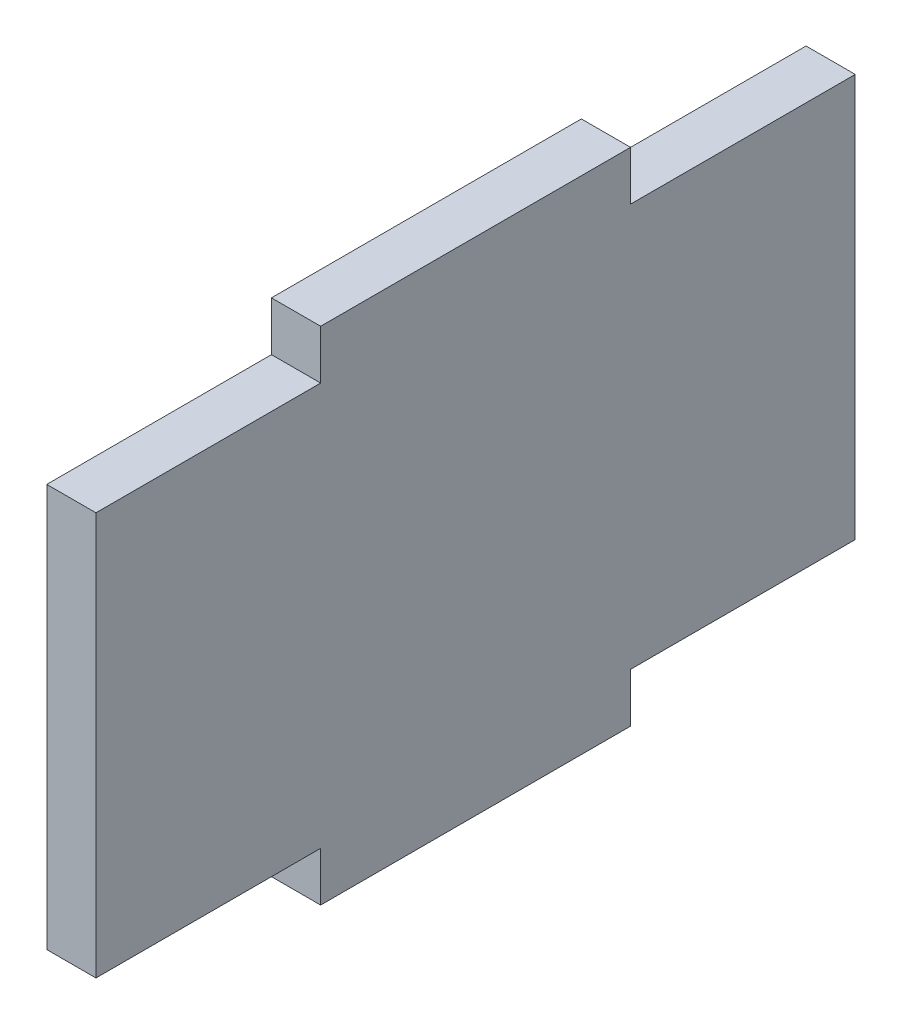
ISO-10303-21;
HEADER;
FILE_DESCRIPTION(('STEP AP214'),'2;1');
FILE_NAME('part.step','',(''),(''),'','','');
FILE_SCHEMA(('AUTOMOTIVE_DESIGN { 1 0 10303 214 1 1 1 1 }'));
ENDSEC;
DATA;
#1=APPLICATION_CONTEXT('core data for automotive mechanical design processes');
#2=APPLICATION_PROTOCOL_DEFINITION('international standard','automotive_design',2000,#1);
#3=PRODUCT_CONTEXT('',#1,'mechanical');
#4=PRODUCT('Part','Part','',(#3));
#5=PRODUCT_RELATED_PRODUCT_CATEGORY('part','',(#4));
#6=PRODUCT_DEFINITION_FORMATION('','',#4);
#7=PRODUCT_DEFINITION_CONTEXT('part definition',#1,'design');
#8=PRODUCT_DEFINITION('design','',#6,#7);
#9=PRODUCT_DEFINITION_SHAPE('','',#8);
#10=(LENGTH_UNIT() NAMED_UNIT(*) SI_UNIT(.MILLI.,.METRE.));
#11=(NAMED_UNIT(*) PLANE_ANGLE_UNIT() SI_UNIT($,.RADIAN.));
#12=(NAMED_UNIT(*) SI_UNIT($,.STERADIAN.) SOLID_ANGLE_UNIT());
#13=UNCERTAINTY_MEASURE_WITH_UNIT(LENGTH_MEASURE(1.E-05),#10,'distance_accuracy_value','');
#14=(GEOMETRIC_REPRESENTATION_CONTEXT(3) GLOBAL_UNCERTAINTY_ASSIGNED_CONTEXT((#13)) GLOBAL_UNIT_ASSIGNED_CONTEXT((#10,
#11,#12)) REPRESENTATION_CONTEXT('',''));
#15=CARTESIAN_POINT('',(0.,0.,0.));
#16=DIRECTION('',(0.,0.,1.));
#17=DIRECTION('',(1.,0.,0.));
#18=AXIS2_PLACEMENT_3D('',#15,#16,#17);
#19=CARTESIAN_POINT('',(3.175,0.,-10.));
#20=DIRECTION('',(0.,0.,-1.));
#21=DIRECTION('',(0.,1.,0.));
#22=AXIS2_PLACEMENT_3D('',#19,#20,#21);
#23=PLANE('',#22);
#24=DIRECTION('',(0.,-1.,0.));
#25=VECTOR('',#24,1.);
#26=CARTESIAN_POINT('',(0.,0.,-10.));
#27=LINE('',#26,#25);
#28=CARTESIAN_POINT('',(0.,16.175,-10.));
#29=VERTEX_POINT('',#28);
#30=CARTESIAN_POINT('',(0.,13.,-10.));
#31=VERTEX_POINT('',#30);
#32=EDGE_CURVE('E152',#29,#31,#27,.T.);
#33=ORIENTED_EDGE('',*,*,#32,.F.);
#34=DIRECTION('',(-1.,0.,0.));
#35=VECTOR('',#34,1.);
#36=CARTESIAN_POINT('',(3.175,16.175,-10.));
#37=LINE('',#36,#35);
#38=CARTESIAN_POINT('',(3.175,16.175,-10.));
#39=VERTEX_POINT('',#38);
#40=EDGE_CURVE('E11',#39,#29,#37,.T.);
#41=ORIENTED_EDGE('',*,*,#40,.F.);
#42=DIRECTION('',(0.,-1.,0.));
#43=VECTOR('',#42,1.);
#44=CARTESIAN_POINT('',(3.175,0.,-10.));
#45=LINE('',#44,#43);
#46=CARTESIAN_POINT('',(3.175,13.,-10.));
#47=VERTEX_POINT('',#46);
#48=EDGE_CURVE('E211',#39,#47,#45,.T.);
#49=ORIENTED_EDGE('',*,*,#48,.T.);
#50=DIRECTION('',(-1.,0.,0.));
#51=VECTOR('',#50,1.);
#52=CARTESIAN_POINT('',(3.175,13.,-10.));
#53=LINE('',#52,#51);
#54=EDGE_CURVE('E48',#47,#31,#53,.T.);
#55=ORIENTED_EDGE('',*,*,#54,.T.);
#56=EDGE_LOOP('',(#33,#41,#49,#55));
#57=FACE_BOUND('',#56,.T.);
#58=ADVANCED_FACE('F32',(#57),#23,.T.);
#59=CARTESIAN_POINT('',(3.175,16.175,0.));
#60=DIRECTION('',(0.,1.,0.));
#61=DIRECTION('',(0.,0.,1.));
#62=AXIS2_PLACEMENT_3D('',#59,#60,#61);
#63=PLANE('',#62);
#64=DIRECTION('',(0.,0.,-1.));
#65=VECTOR('',#64,1.);
#66=CARTESIAN_POINT('',(0.,16.175,0.));
#67=LINE('',#66,#65);
#68=CARTESIAN_POINT('',(0.,16.175,10.));
#69=VERTEX_POINT('',#68);
#70=EDGE_CURVE('E154',#69,#29,#67,.T.);
#71=ORIENTED_EDGE('',*,*,#70,.F.);
#72=DIRECTION('',(-1.,0.,0.));
#73=VECTOR('',#72,1.);
#74=CARTESIAN_POINT('',(3.175,16.175,10.));
#75=LINE('',#74,#73);
#76=CARTESIAN_POINT('',(3.175,16.175,10.));
#77=VERTEX_POINT('',#76);
#78=EDGE_CURVE('E40',#77,#69,#75,.T.);
#79=ORIENTED_EDGE('',*,*,#78,.F.);
#80=DIRECTION('',(0.,0.,-1.));
#81=VECTOR('',#80,1.);
#82=CARTESIAN_POINT('',(3.175,16.175,0.));
#83=LINE('',#82,#81);
#84=EDGE_CURVE('E208',#77,#39,#83,.T.);
#85=ORIENTED_EDGE('',*,*,#84,.T.);
#86=ORIENTED_EDGE('',*,*,#40,.T.);
#87=EDGE_LOOP('',(#71,#79,#85,#86));
#88=FACE_BOUND('',#87,.T.);
#89=ADVANCED_FACE('F207',(#88),#63,.T.);
#90=CARTESIAN_POINT('',(3.175,0.,10.));
#91=DIRECTION('',(0.,0.,-1.));
#92=DIRECTION('',(-1.,0.,0.));
#93=AXIS2_PLACEMENT_3D('',#90,#91,#92);
#94=PLANE('',#93);
#95=DIRECTION('',(0.,-1.,0.));
#96=VECTOR('',#95,1.);
#97=CARTESIAN_POINT('',(0.,0.,10.));
#98=LINE('',#97,#96);
#99=CARTESIAN_POINT('',(0.,13.,10.));
#100=VERTEX_POINT('',#99);
#101=EDGE_CURVE('E157',#69,#100,#98,.T.);
#102=ORIENTED_EDGE('',*,*,#101,.T.);
#103=DIRECTION('',(-1.,0.,0.));
#104=VECTOR('',#103,1.);
#105=CARTESIAN_POINT('',(3.175,13.,10.));
#106=LINE('',#105,#104);
#107=CARTESIAN_POINT('',(3.175,13.,10.));
#108=VERTEX_POINT('',#107);
#109=EDGE_CURVE('E193',#108,#100,#106,.T.);
#110=ORIENTED_EDGE('',*,*,#109,.F.);
#111=DIRECTION('',(0.,-1.,0.));
#112=VECTOR('',#111,1.);
#113=CARTESIAN_POINT('',(3.175,0.,10.));
#114=LINE('',#113,#112);
#115=EDGE_CURVE('E199',#77,#108,#114,.T.);
#116=ORIENTED_EDGE('',*,*,#115,.F.);
#117=ORIENTED_EDGE('',*,*,#78,.T.);
#118=EDGE_LOOP('',(#102,#110,#116,#117));
#119=FACE_BOUND('',#118,.T.);
#120=ADVANCED_FACE('F197',(#119),#94,.F.);
#121=CARTESIAN_POINT('',(3.175,13.,0.));
#122=DIRECTION('',(0.,1.,0.));
#123=DIRECTION('',(0.,0.,1.));
#124=AXIS2_PLACEMENT_3D('',#121,#122,#123);
#125=PLANE('',#124);
#126=DIRECTION('',(0.,0.,-1.));
#127=VECTOR('',#126,1.);
#128=CARTESIAN_POINT('',(0.,13.,0.));
#129=LINE('',#128,#127);
#130=CARTESIAN_POINT('',(0.,13.,24.5));
#131=VERTEX_POINT('',#130);
#132=EDGE_CURVE('E160',#131,#100,#129,.T.);
#133=ORIENTED_EDGE('',*,*,#132,.F.);
#134=DIRECTION('',(-1.,0.,0.));
#135=VECTOR('',#134,1.);
#136=CARTESIAN_POINT('',(3.175,13.,24.5));
#137=LINE('',#136,#135);
#138=CARTESIAN_POINT('',(3.175,13.,24.5));
#139=VERTEX_POINT('',#138);
#140=EDGE_CURVE('E191',#139,#131,#137,.T.);
#141=ORIENTED_EDGE('',*,*,#140,.F.);
#142=DIRECTION('',(0.,0.,-1.));
#143=VECTOR('',#142,1.);
#144=CARTESIAN_POINT('',(3.175,13.,0.));
#145=LINE('',#144,#143);
#146=EDGE_CURVE('E148',#139,#108,#145,.T.);
#147=ORIENTED_EDGE('',*,*,#146,.T.);
#148=ORIENTED_EDGE('',*,*,#109,.T.);
#149=EDGE_LOOP('',(#133,#141,#147,#148));
#150=FACE_BOUND('',#149,.T.);
#151=ADVANCED_FACE('F246',(#150),#125,.T.);
#152=CARTESIAN_POINT('',(3.175,0.,24.5));
#153=DIRECTION('',(0.,0.,1.));
#154=DIRECTION('',(1.,0.,0.));
#155=AXIS2_PLACEMENT_3D('',#152,#153,#154);
#156=PLANE('',#155);
#157=DIRECTION('',(0.,1.,0.));
#158=VECTOR('',#157,1.);
#159=CARTESIAN_POINT('',(0.,0.,24.5));
#160=LINE('',#159,#158);
#161=CARTESIAN_POINT('',(0.,-13.,24.5));
#162=VERTEX_POINT('',#161);
#163=EDGE_CURVE('E163',#162,#131,#160,.T.);
#164=ORIENTED_EDGE('',*,*,#163,.F.);
#165=DIRECTION('',(-1.,0.,0.));
#166=VECTOR('',#165,1.);
#167=CARTESIAN_POINT('',(3.175,-13.,24.5));
#168=LINE('',#167,#166);
#169=CARTESIAN_POINT('',(3.175,-13.,24.5));
#170=VERTEX_POINT('',#169);
#171=EDGE_CURVE('E189',#170,#162,#168,.T.);
#172=ORIENTED_EDGE('',*,*,#171,.F.);
#173=DIRECTION('',(0.,1.,0.));
#174=VECTOR('',#173,1.);
#175=CARTESIAN_POINT('',(3.175,0.,24.5));
#176=LINE('',#175,#174);
#177=EDGE_CURVE('E217',#170,#139,#176,.T.);
#178=ORIENTED_EDGE('',*,*,#177,.T.);
#179=ORIENTED_EDGE('',*,*,#140,.T.);
#180=EDGE_LOOP('',(#164,#172,#178,#179));
#181=FACE_BOUND('',#180,.T.);
#182=ADVANCED_FACE('F242',(#181),#156,.T.);
#183=CARTESIAN_POINT('',(3.175,-13.,0.));
#184=DIRECTION('',(0.,1.,0.));
#185=DIRECTION('',(0.,0.,1.));
#186=AXIS2_PLACEMENT_3D('',#183,#184,#185);
#187=PLANE('',#186);
#188=DIRECTION('',(0.,0.,-1.));
#189=VECTOR('',#188,1.);
#190=CARTESIAN_POINT('',(0.,-13.,0.));
#191=LINE('',#190,#189);
#192=CARTESIAN_POINT('',(0.,-13.,10.));
#193=VERTEX_POINT('',#192);
#194=EDGE_CURVE('E167',#162,#193,#191,.T.);
#195=ORIENTED_EDGE('',*,*,#194,.T.);
#196=DIRECTION('',(-1.,0.,0.));
#197=VECTOR('',#196,1.);
#198=CARTESIAN_POINT('',(3.175,-13.,10.));
#199=LINE('',#198,#197);
#200=CARTESIAN_POINT('',(3.175,-13.,10.));
#201=VERTEX_POINT('',#200);
#202=EDGE_CURVE('E187',#201,#193,#199,.T.);
#203=ORIENTED_EDGE('',*,*,#202,.F.);
#204=DIRECTION('',(0.,0.,-1.));
#205=VECTOR('',#204,1.);
#206=CARTESIAN_POINT('',(3.175,-13.,0.));
#207=LINE('',#206,#205);
#208=EDGE_CURVE('E134',#170,#201,#207,.T.);
#209=ORIENTED_EDGE('',*,*,#208,.F.);
#210=ORIENTED_EDGE('',*,*,#171,.T.);
#211=EDGE_LOOP('',(#195,#203,#209,#210));
#212=FACE_BOUND('',#211,.T.);
#213=ADVANCED_FACE('F239',(#212),#187,.F.);
#214=CARTESIAN_POINT('',(3.175,0.,10.));
#215=DIRECTION('',(0.,0.,1.));
#216=DIRECTION('',(1.,0.,0.));
#217=AXIS2_PLACEMENT_3D('',#214,#215,#216);
#218=PLANE('',#217);
#219=DIRECTION('',(0.,1.,0.));
#220=VECTOR('',#219,1.);
#221=CARTESIAN_POINT('',(0.,0.,10.));
#222=LINE('',#221,#220);
#223=CARTESIAN_POINT('',(0.,-16.175,10.));
#224=VERTEX_POINT('',#223);
#225=EDGE_CURVE('E170',#224,#193,#222,.T.);
#226=ORIENTED_EDGE('',*,*,#225,.F.);
#227=DIRECTION('',(-1.,0.,0.));
#228=VECTOR('',#227,1.);
#229=CARTESIAN_POINT('',(3.175,-16.175,10.));
#230=LINE('',#229,#228);
#231=CARTESIAN_POINT('',(3.175,-16.175,10.));
#232=VERTEX_POINT('',#231);
#233=EDGE_CURVE('E185',#232,#224,#230,.T.);
#234=ORIENTED_EDGE('',*,*,#233,.F.);
#235=DIRECTION('',(0.,1.,0.));
#236=VECTOR('',#235,1.);
#237=CARTESIAN_POINT('',(3.175,0.,10.));
#238=LINE('',#237,#236);
#239=EDGE_CURVE('E220',#232,#201,#238,.T.);
#240=ORIENTED_EDGE('',*,*,#239,.T.);
#241=ORIENTED_EDGE('',*,*,#202,.T.);
#242=EDGE_LOOP('',(#226,#234,#240,#241));
#243=FACE_BOUND('',#242,.T.);
#244=ADVANCED_FACE('F235',(#243),#218,.T.);
#245=CARTESIAN_POINT('',(3.175,-16.175,0.));
#246=DIRECTION('',(0.,1.,0.));
#247=DIRECTION('',(0.,0.,1.));
#248=AXIS2_PLACEMENT_3D('',#245,#246,#247);
#249=PLANE('',#248);
#250=DIRECTION('',(0.,0.,-1.));
#251=VECTOR('',#250,1.);
#252=CARTESIAN_POINT('',(0.,-16.175,0.));
#253=LINE('',#252,#251);
#254=CARTESIAN_POINT('',(0.,-16.175,-10.));
#255=VERTEX_POINT('',#254);
#256=EDGE_CURVE('E173',#224,#255,#253,.T.);
#257=ORIENTED_EDGE('',*,*,#256,.T.);
#258=DIRECTION('',(-1.,0.,0.));
#259=VECTOR('',#258,1.);
#260=CARTESIAN_POINT('',(3.175,-16.175,-10.));
#261=LINE('',#260,#259);
#262=CARTESIAN_POINT('',(3.175,-16.175,-10.));
#263=VERTEX_POINT('',#262);
#264=EDGE_CURVE('E182',#263,#255,#261,.T.);
#265=ORIENTED_EDGE('',*,*,#264,.F.);
#266=DIRECTION('',(0.,0.,-1.));
#267=VECTOR('',#266,1.);
#268=CARTESIAN_POINT('',(3.175,-16.175,0.));
#269=LINE('',#268,#267);
#270=EDGE_CURVE('E222',#232,#263,#269,.T.);
#271=ORIENTED_EDGE('',*,*,#270,.F.);
#272=ORIENTED_EDGE('',*,*,#233,.T.);
#273=EDGE_LOOP('',(#257,#265,#271,#272));
#274=FACE_BOUND('',#273,.T.);
#275=ADVANCED_FACE('F227',(#274),#249,.F.);
#276=CARTESIAN_POINT('',(3.175,0.,-10.));
#277=DIRECTION('',(0.,0.,1.));
#278=DIRECTION('',(0.,-1.,0.));
#279=AXIS2_PLACEMENT_3D('',#276,#277,#278);
#280=PLANE('',#279);
#281=DIRECTION('',(0.,1.,0.));
#282=VECTOR('',#281,1.);
#283=CARTESIAN_POINT('',(0.,0.,-10.));
#284=LINE('',#283,#282);
#285=CARTESIAN_POINT('',(0.,-13.,-10.));
#286=VERTEX_POINT('',#285);
#287=EDGE_CURVE('E175',#255,#286,#284,.T.);
#288=ORIENTED_EDGE('',*,*,#287,.T.);
#289=DIRECTION('',(-1.,0.,0.));
#290=VECTOR('',#289,1.);
#291=CARTESIAN_POINT('',(3.175,-13.,-10.));
#292=LINE('',#291,#290);
#293=CARTESIAN_POINT('',(3.175,-13.,-10.));
#294=VERTEX_POINT('',#293);
#295=EDGE_CURVE('E142',#294,#286,#292,.T.);
#296=ORIENTED_EDGE('',*,*,#295,.F.);
#297=DIRECTION('',(0.,1.,0.));
#298=VECTOR('',#297,1.);
#299=CARTESIAN_POINT('',(3.175,0.,-10.));
#300=LINE('',#299,#298);
#301=EDGE_CURVE('E129',#263,#294,#300,.T.);
#302=ORIENTED_EDGE('',*,*,#301,.F.);
#303=ORIENTED_EDGE('',*,*,#264,.T.);
#304=EDGE_LOOP('',(#288,#296,#302,#303));
#305=FACE_BOUND('',#304,.T.);
#306=ADVANCED_FACE('F231',(#305),#280,.F.);
#307=CARTESIAN_POINT('',(0.,-13.,-24.5));
#308=VERTEX_POINT('',#307);
#309=EDGE_CURVE('E139',#286,#308,#191,.T.);
#310=ORIENTED_EDGE('',*,*,#309,.T.);
#311=DIRECTION('',(-1.,0.,0.));
#312=VECTOR('',#311,1.);
#313=CARTESIAN_POINT('',(3.175,-13.,-24.5));
#314=LINE('',#313,#312);
#315=CARTESIAN_POINT('',(3.175,-13.,-24.5));
#316=VERTEX_POINT('',#315);
#317=EDGE_CURVE('E136',#316,#308,#314,.T.);
#318=ORIENTED_EDGE('',*,*,#317,.F.);
#319=EDGE_CURVE('E122',#294,#316,#207,.T.);
#320=ORIENTED_EDGE('',*,*,#319,.F.);
#321=ORIENTED_EDGE('',*,*,#295,.T.);
#322=EDGE_LOOP('',(#310,#318,#320,#321));
#323=FACE_BOUND('',#322,.T.);
#324=ADVANCED_FACE('F137',(#323),#187,.F.);
#325=CARTESIAN_POINT('',(3.175,0.,-24.5));
#326=DIRECTION('',(0.,0.,1.));
#327=DIRECTION('',(1.,0.,0.));
#328=AXIS2_PLACEMENT_3D('',#325,#326,#327);
#329=PLANE('',#328);
#330=DIRECTION('',(0.,1.,0.));
#331=VECTOR('',#330,1.);
#332=CARTESIAN_POINT('',(0.,0.,-24.5));
#333=LINE('',#332,#331);
#334=CARTESIAN_POINT('',(0.,13.,-24.5));
#335=VERTEX_POINT('',#334);
#336=EDGE_CURVE('E177',#308,#335,#333,.T.);
#337=ORIENTED_EDGE('',*,*,#336,.T.);
#338=DIRECTION('',(-1.,0.,0.));
#339=VECTOR('',#338,1.);
#340=CARTESIAN_POINT('',(3.175,13.,-24.5));
#341=LINE('',#340,#339);
#342=CARTESIAN_POINT('',(3.175,13.,-24.5));
#343=VERTEX_POINT('',#342);
#344=EDGE_CURVE('E86',#343,#335,#341,.T.);
#345=ORIENTED_EDGE('',*,*,#344,.F.);
#346=DIRECTION('',(0.,1.,0.));
#347=VECTOR('',#346,1.);
#348=CARTESIAN_POINT('',(3.175,0.,-24.5));
#349=LINE('',#348,#347);
#350=EDGE_CURVE('E127',#316,#343,#349,.T.);
#351=ORIENTED_EDGE('',*,*,#350,.F.);
#352=ORIENTED_EDGE('',*,*,#317,.T.);
#353=EDGE_LOOP('',(#337,#345,#351,#352));
#354=FACE_BOUND('',#353,.T.);
#355=ADVANCED_FACE('F144',(#354),#329,.F.);
#356=EDGE_CURVE('E164',#31,#335,#129,.T.);
#357=ORIENTED_EDGE('',*,*,#356,.F.);
#358=ORIENTED_EDGE('',*,*,#54,.F.);
#359=EDGE_CURVE('E145',#47,#343,#145,.T.);
#360=ORIENTED_EDGE('',*,*,#359,.T.);
#361=ORIENTED_EDGE('',*,*,#344,.T.);
#362=EDGE_LOOP('',(#357,#358,#360,#361));
#363=FACE_BOUND('',#362,.T.);
#364=ADVANCED_FACE('F210',(#363),#125,.T.);
#365=CARTESIAN_POINT('',(3.175,0.,0.));
#366=DIRECTION('',(1.,0.,0.));
#367=DIRECTION('',(0.,0.,-1.));
#368=AXIS2_PLACEMENT_3D('',#365,#366,#367);
#369=PLANE('',#368);
#370=ORIENTED_EDGE('',*,*,#48,.F.);
#371=ORIENTED_EDGE('',*,*,#84,.F.);
#372=ORIENTED_EDGE('',*,*,#115,.T.);
#373=ORIENTED_EDGE('',*,*,#146,.F.);
#374=ORIENTED_EDGE('',*,*,#177,.F.);
#375=ORIENTED_EDGE('',*,*,#208,.T.);
#376=ORIENTED_EDGE('',*,*,#239,.F.);
#377=ORIENTED_EDGE('',*,*,#270,.T.);
#378=ORIENTED_EDGE('',*,*,#301,.T.);
#379=ORIENTED_EDGE('',*,*,#319,.T.);
#380=ORIENTED_EDGE('',*,*,#350,.T.);
#381=ORIENTED_EDGE('',*,*,#359,.F.);
#382=EDGE_LOOP('',(#370,#371,#372,#373,#374,#375,#376,#377,#378,#379,#380,#381));
#383=FACE_BOUND('',#382,.T.);
#384=ADVANCED_FACE('F124',(#383),#369,.T.);
#385=CARTESIAN_POINT('',(0.,0.,0.));
#386=DIRECTION('',(1.,0.,0.));
#387=DIRECTION('',(0.,0.,-1.));
#388=AXIS2_PLACEMENT_3D('',#385,#386,#387);
#389=PLANE('',#388);
#390=ORIENTED_EDGE('',*,*,#32,.T.);
#391=ORIENTED_EDGE('',*,*,#356,.T.);
#392=ORIENTED_EDGE('',*,*,#336,.F.);
#393=ORIENTED_EDGE('',*,*,#309,.F.);
#394=ORIENTED_EDGE('',*,*,#287,.F.);
#395=ORIENTED_EDGE('',*,*,#256,.F.);
#396=ORIENTED_EDGE('',*,*,#225,.T.);
#397=ORIENTED_EDGE('',*,*,#194,.F.);
#398=ORIENTED_EDGE('',*,*,#163,.T.);
#399=ORIENTED_EDGE('',*,*,#132,.T.);
#400=ORIENTED_EDGE('',*,*,#101,.F.);
#401=ORIENTED_EDGE('',*,*,#70,.T.);
#402=EDGE_LOOP('',(#390,#391,#392,#393,#394,#395,#396,#397,#398,#399,#400,#401));
#403=FACE_BOUND('',#402,.T.);
#404=ADVANCED_FACE('F205',(#403),#389,.F.);
#405=CLOSED_SHELL('',(#58,#89,#120,#151,#182,#213,#244,#275,#306,#324,#355,#364,#384,#404));
#406=MANIFOLD_SOLID_BREP('B2',#405);
#407=ADVANCED_BREP_SHAPE_REPRESENTATION('',(#18,#406),#14);
#408=SHAPE_DEFINITION_REPRESENTATION(#9,#407);
ENDSEC;
END-ISO-10303-21;
